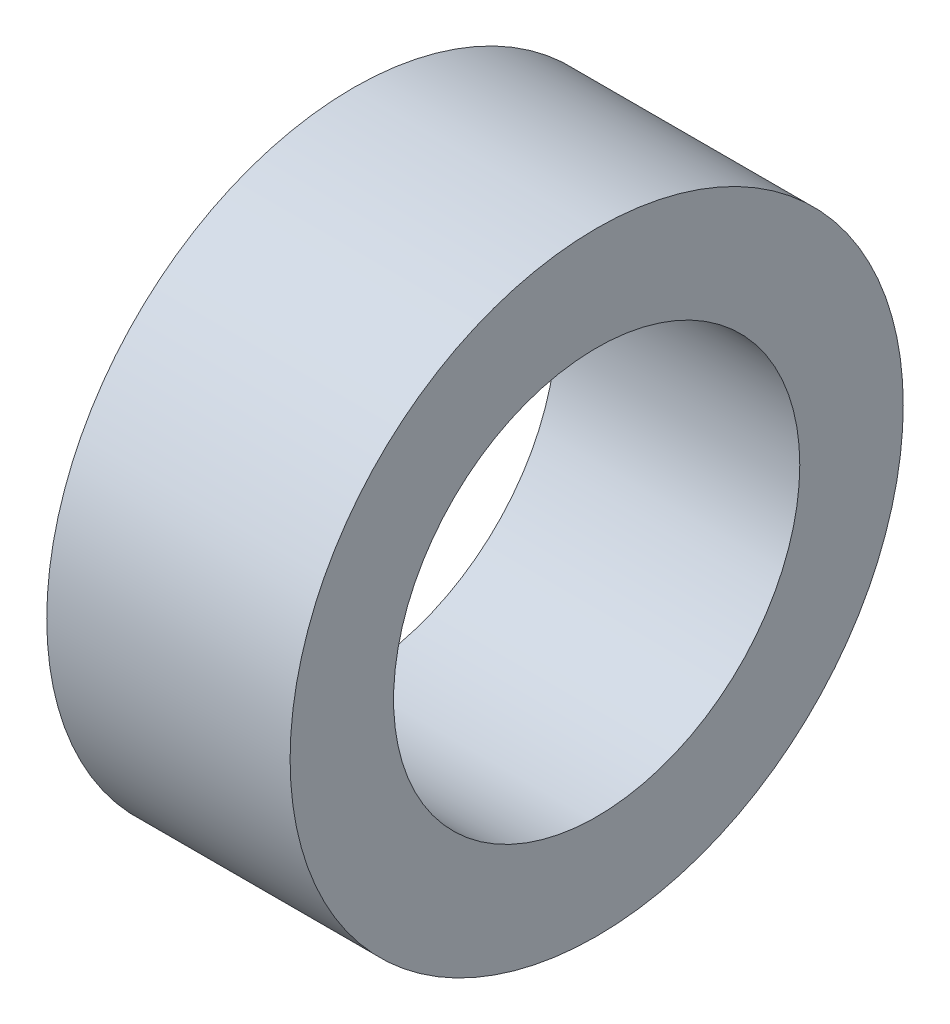
ISO-10303-21;
HEADER;
FILE_DESCRIPTION(('STEP AP214'),'2;1');
FILE_NAME('part.step','',(''),(''),'','','');
FILE_SCHEMA(('AUTOMOTIVE_DESIGN { 1 0 10303 214 1 1 1 1 }'));
ENDSEC;
DATA;
#1=APPLICATION_CONTEXT('core data for automotive mechanical design processes');
#2=APPLICATION_PROTOCOL_DEFINITION('international standard','automotive_design',2000,#1);
#3=PRODUCT_CONTEXT('',#1,'mechanical');
#4=PRODUCT('Part','Part','',(#3));
#5=PRODUCT_RELATED_PRODUCT_CATEGORY('part','',(#4));
#6=PRODUCT_DEFINITION_FORMATION('','',#4);
#7=PRODUCT_DEFINITION_CONTEXT('part definition',#1,'design');
#8=PRODUCT_DEFINITION('design','',#6,#7);
#9=PRODUCT_DEFINITION_SHAPE('','',#8);
#10=(LENGTH_UNIT() NAMED_UNIT(*) SI_UNIT(.MILLI.,.METRE.));
#11=(NAMED_UNIT(*) PLANE_ANGLE_UNIT() SI_UNIT($,.RADIAN.));
#12=(NAMED_UNIT(*) SI_UNIT($,.STERADIAN.) SOLID_ANGLE_UNIT());
#13=UNCERTAINTY_MEASURE_WITH_UNIT(LENGTH_MEASURE(1.E-05),#10,'distance_accuracy_value','');
#14=(GEOMETRIC_REPRESENTATION_CONTEXT(3) GLOBAL_UNCERTAINTY_ASSIGNED_CONTEXT((#13)) GLOBAL_UNIT_ASSIGNED_CONTEXT((#10,
#11,#12)) REPRESENTATION_CONTEXT('',''));
#15=CARTESIAN_POINT('',(0.,0.,0.));
#16=DIRECTION('',(0.,0.,1.));
#17=DIRECTION('',(1.,0.,0.));
#18=AXIS2_PLACEMENT_3D('',#15,#16,#17);
#19=CARTESIAN_POINT('',(3.175,0.,0.));
#20=DIRECTION('',(1.,0.,0.));
#21=DIRECTION('',(0.,0.,-1.));
#22=AXIS2_PLACEMENT_3D('',#19,#20,#21);
#23=PLANE('',#22);
#24=CARTESIAN_POINT('',(3.175,0.,0.));
#25=DIRECTION('',(1.,0.,0.));
#26=DIRECTION('',(0.,0.,-1.));
#27=AXIS2_PLACEMENT_3D('',#24,#25,#26);
#28=CIRCLE('',#27,4.);
#29=CARTESIAN_POINT('',(3.175,0.,-4.));
#30=VERTEX_POINT('',#29);
#31=EDGE_CURVE('E10',#30,#30,#28,.T.);
#32=ORIENTED_EDGE('',*,*,#31,.T.);
#33=EDGE_LOOP('',(#32));
#34=FACE_BOUND('',#33,.T.);
#35=CARTESIAN_POINT('',(3.175,0.,0.));
#36=DIRECTION('',(1.,0.,0.));
#37=DIRECTION('',(0.,0.,-1.));
#38=AXIS2_PLACEMENT_3D('',#35,#36,#37);
#39=CIRCLE('',#38,2.65);
#40=CARTESIAN_POINT('',(3.175,0.,-2.65));
#41=VERTEX_POINT('',#40);
#42=EDGE_CURVE('E41',#41,#41,#39,.T.);
#43=ORIENTED_EDGE('',*,*,#42,.F.);
#44=EDGE_LOOP('',(#43));
#45=FACE_BOUND('',#44,.T.);
#46=ADVANCED_FACE('F30',(#34,#45),#23,.T.);
#47=CARTESIAN_POINT('',(0.,0.,0.));
#48=DIRECTION('',(1.,0.,0.));
#49=DIRECTION('',(0.,0.,-1.));
#50=AXIS2_PLACEMENT_3D('',#47,#48,#49);
#51=PLANE('',#50);
#52=CARTESIAN_POINT('',(0.,0.,0.));
#53=DIRECTION('',(1.,0.,0.));
#54=DIRECTION('',(0.,0.,-1.));
#55=AXIS2_PLACEMENT_3D('',#52,#53,#54);
#56=CIRCLE('',#55,4.);
#57=CARTESIAN_POINT('',(0.,0.,-4.));
#58=VERTEX_POINT('',#57);
#59=EDGE_CURVE('E34',#58,#58,#56,.T.);
#60=ORIENTED_EDGE('',*,*,#59,.F.);
#61=EDGE_LOOP('',(#60));
#62=FACE_BOUND('',#61,.T.);
#63=CARTESIAN_POINT('',(0.,0.,0.));
#64=DIRECTION('',(1.,0.,0.));
#65=DIRECTION('',(0.,0.,-1.));
#66=AXIS2_PLACEMENT_3D('',#63,#64,#65);
#67=CIRCLE('',#66,2.65);
#68=CARTESIAN_POINT('',(0.,0.,-2.65));
#69=VERTEX_POINT('',#68);
#70=EDGE_CURVE('E43',#69,#69,#67,.T.);
#71=ORIENTED_EDGE('',*,*,#70,.T.);
#72=EDGE_LOOP('',(#71));
#73=FACE_BOUND('',#72,.T.);
#74=ADVANCED_FACE('F53',(#62,#73),#51,.F.);
#75=CARTESIAN_POINT('',(3.175,0.,0.));
#76=DIRECTION('',(-1.,0.,0.));
#77=DIRECTION('',(0.,0.,1.));
#78=AXIS2_PLACEMENT_3D('',#75,#76,#77);
#79=CYLINDRICAL_SURFACE('',#78,4.);
#80=ORIENTED_EDGE('',*,*,#31,.F.);
#81=EDGE_LOOP('',(#80));
#82=FACE_BOUND('',#81,.T.);
#83=ORIENTED_EDGE('',*,*,#59,.T.);
#84=EDGE_LOOP('',(#83));
#85=FACE_BOUND('',#84,.T.);
#86=ADVANCED_FACE('F32',(#82,#85),#79,.T.);
#87=CARTESIAN_POINT('',(3.175,0.,0.));
#88=DIRECTION('',(-1.,0.,0.));
#89=DIRECTION('',(0.,0.,1.));
#90=AXIS2_PLACEMENT_3D('',#87,#88,#89);
#91=CYLINDRICAL_SURFACE('',#90,2.65);
#92=ORIENTED_EDGE('',*,*,#42,.T.);
#93=EDGE_LOOP('',(#92));
#94=FACE_BOUND('',#93,.T.);
#95=ORIENTED_EDGE('',*,*,#70,.F.);
#96=EDGE_LOOP('',(#95));
#97=FACE_BOUND('',#96,.T.);
#98=ADVANCED_FACE('F49',(#94,#97),#91,.F.);
#99=CLOSED_SHELL('',(#46,#74,#86,#98));
#100=MANIFOLD_SOLID_BREP('B2',#99);
#101=ADVANCED_BREP_SHAPE_REPRESENTATION('',(#18,#100),#14);
#102=SHAPE_DEFINITION_REPRESENTATION(#9,#101);
ENDSEC;
END-ISO-10303-21;
